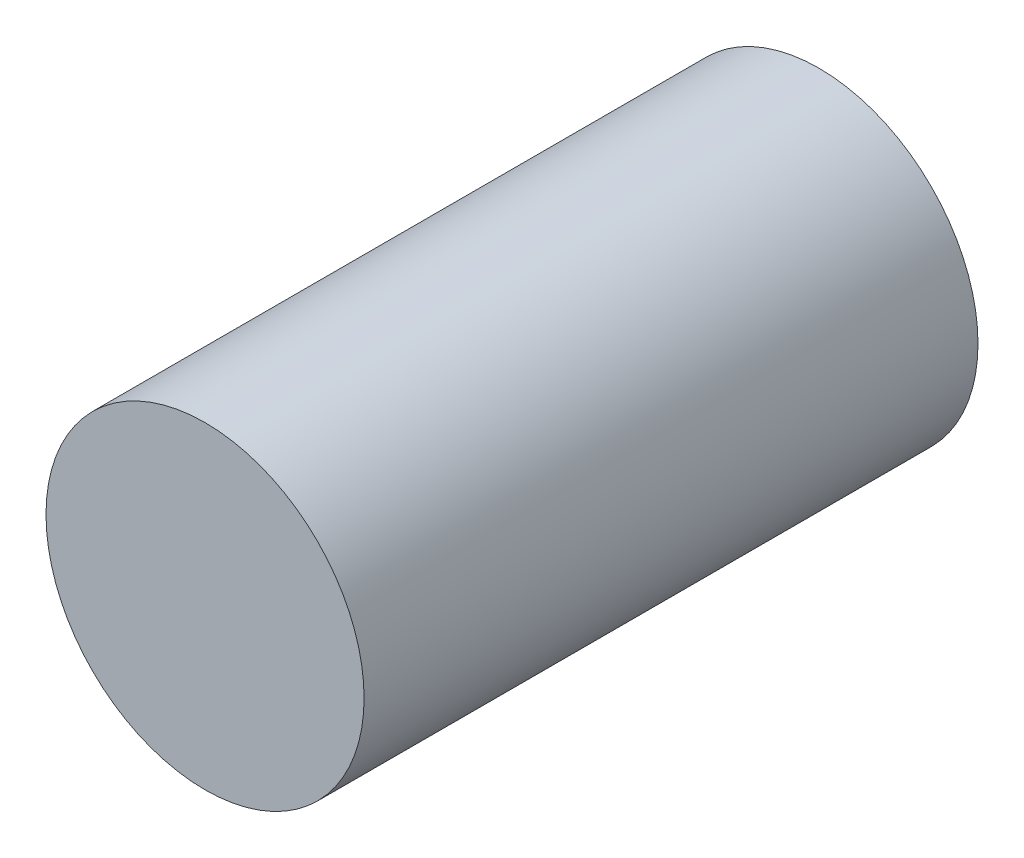
ISO-10303-21;
HEADER;
FILE_DESCRIPTION(('STEP AP214'),'2;1');
FILE_NAME('part.step','',(''),(''),'','','');
FILE_SCHEMA(('AUTOMOTIVE_DESIGN { 1 0 10303 214 1 1 1 1 }'));
ENDSEC;
DATA;
#1=APPLICATION_CONTEXT('core data for automotive mechanical design processes');
#2=APPLICATION_PROTOCOL_DEFINITION('international standard','automotive_design',2000,#1);
#3=PRODUCT_CONTEXT('',#1,'mechanical');
#4=PRODUCT('Part','Part','',(#3));
#5=PRODUCT_RELATED_PRODUCT_CATEGORY('part','',(#4));
#6=PRODUCT_DEFINITION_FORMATION('','',#4);
#7=PRODUCT_DEFINITION_CONTEXT('part definition',#1,'design');
#8=PRODUCT_DEFINITION('design','',#6,#7);
#9=PRODUCT_DEFINITION_SHAPE('','',#8);
#10=(LENGTH_UNIT() NAMED_UNIT(*) SI_UNIT(.MILLI.,.METRE.));
#11=(NAMED_UNIT(*) PLANE_ANGLE_UNIT() SI_UNIT($,.RADIAN.));
#12=(NAMED_UNIT(*) SI_UNIT($,.STERADIAN.) SOLID_ANGLE_UNIT());
#13=UNCERTAINTY_MEASURE_WITH_UNIT(LENGTH_MEASURE(1.E-05),#10,'distance_accuracy_value','');
#14=(GEOMETRIC_REPRESENTATION_CONTEXT(3) GLOBAL_UNCERTAINTY_ASSIGNED_CONTEXT((#13)) GLOBAL_UNIT_ASSIGNED_CONTEXT((#10,
#11,#12)) REPRESENTATION_CONTEXT('',''));
#15=CARTESIAN_POINT('',(0.,0.,0.));
#16=DIRECTION('',(0.,0.,1.));
#17=DIRECTION('',(1.,0.,0.));
#18=AXIS2_PLACEMENT_3D('',#15,#16,#17);
#19=CARTESIAN_POINT('',(0.,0.,1.93));
#20=DIRECTION('',(0.,0.,-1.));
#21=DIRECTION('',(-1.,0.,0.));
#22=AXIS2_PLACEMENT_3D('',#19,#20,#21);
#23=CYLINDRICAL_SURFACE('',#22,1.);
#24=CARTESIAN_POINT('',(0.,0.,1.93));
#25=DIRECTION('',(0.,0.,1.));
#26=DIRECTION('',(1.,0.,0.));
#27=AXIS2_PLACEMENT_3D('',#24,#25,#26);
#28=CIRCLE('',#27,1.);
#29=CARTESIAN_POINT('',(1.,0.,1.93));
#30=VERTEX_POINT('',#29);
#31=EDGE_CURVE('E10',#30,#30,#28,.T.);
#32=ORIENTED_EDGE('',*,*,#31,.F.);
#33=EDGE_LOOP('',(#32));
#34=FACE_BOUND('',#33,.T.);
#35=CARTESIAN_POINT('',(0.,0.,-1.93));
#36=DIRECTION('',(0.,0.,1.));
#37=DIRECTION('',(1.,0.,0.));
#38=AXIS2_PLACEMENT_3D('',#35,#36,#37);
#39=CIRCLE('',#38,1.);
#40=CARTESIAN_POINT('',(1.,0.,-1.93));
#41=VERTEX_POINT('',#40);
#42=EDGE_CURVE('E34',#41,#41,#39,.T.);
#43=ORIENTED_EDGE('',*,*,#42,.T.);
#44=EDGE_LOOP('',(#43));
#45=FACE_BOUND('',#44,.T.);
#46=ADVANCED_FACE('F31',(#34,#45),#23,.T.);
#47=CARTESIAN_POINT('',(0.,0.,1.93));
#48=DIRECTION('',(0.,0.,1.));
#49=DIRECTION('',(1.,0.,0.));
#50=AXIS2_PLACEMENT_3D('',#47,#48,#49);
#51=PLANE('',#50);
#52=ORIENTED_EDGE('',*,*,#31,.T.);
#53=EDGE_LOOP('',(#52));
#54=FACE_BOUND('',#53,.T.);
#55=ADVANCED_FACE('F46',(#54),#51,.T.);
#56=CARTESIAN_POINT('',(0.,0.,-1.93));
#57=DIRECTION('',(0.,0.,1.));
#58=DIRECTION('',(1.,0.,0.));
#59=AXIS2_PLACEMENT_3D('',#56,#57,#58);
#60=PLANE('',#59);
#61=ORIENTED_EDGE('',*,*,#42,.F.);
#62=EDGE_LOOP('',(#61));
#63=FACE_BOUND('',#62,.T.);
#64=ADVANCED_FACE('F44',(#63),#60,.F.);
#65=CLOSED_SHELL('',(#46,#55,#64));
#66=MANIFOLD_SOLID_BREP('B2',#65);
#67=ADVANCED_BREP_SHAPE_REPRESENTATION('',(#18,#66),#14);
#68=SHAPE_DEFINITION_REPRESENTATION(#9,#67);
ENDSEC;
END-ISO-10303-21;
